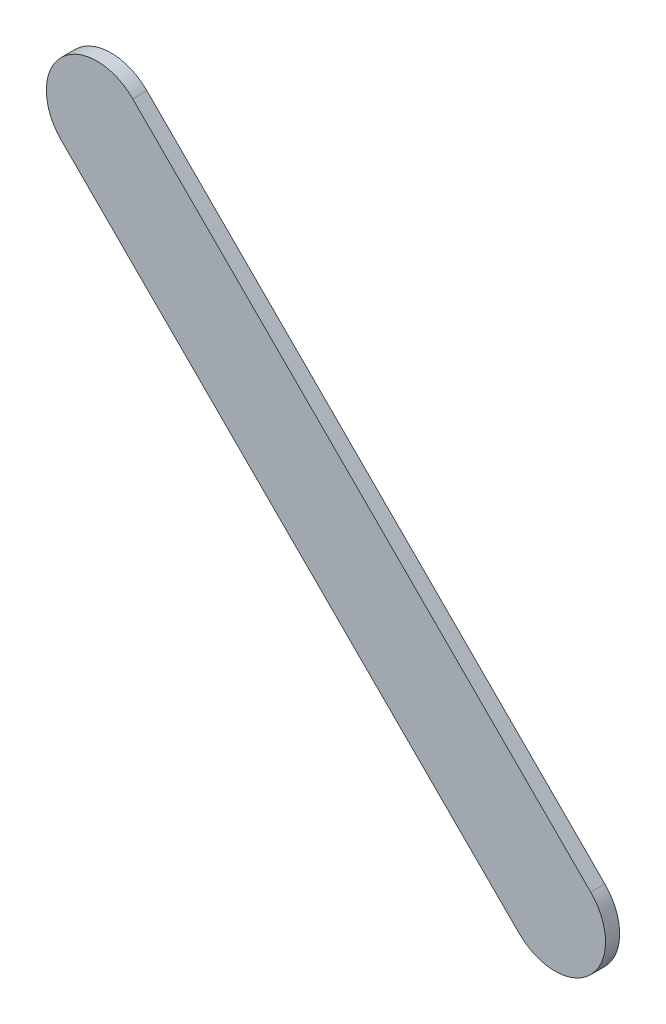
ISO-10303-21;
HEADER;
FILE_DESCRIPTION(('STEP AP214'),'2;1');
FILE_NAME('part.step','',(''),(''),'','','');
FILE_SCHEMA(('AUTOMOTIVE_DESIGN { 1 0 10303 214 1 1 1 1 }'));
ENDSEC;
DATA;
#1=APPLICATION_CONTEXT('core data for automotive mechanical design processes');
#2=APPLICATION_PROTOCOL_DEFINITION('international standard','automotive_design',2000,#1);
#3=PRODUCT_CONTEXT('',#1,'mechanical');
#4=PRODUCT('Part','Part','',(#3));
#5=PRODUCT_RELATED_PRODUCT_CATEGORY('part','',(#4));
#6=PRODUCT_DEFINITION_FORMATION('','',#4);
#7=PRODUCT_DEFINITION_CONTEXT('part definition',#1,'design');
#8=PRODUCT_DEFINITION('design','',#6,#7);
#9=PRODUCT_DEFINITION_SHAPE('','',#8);
#10=(LENGTH_UNIT() NAMED_UNIT(*) SI_UNIT(.MILLI.,.METRE.));
#11=(NAMED_UNIT(*) PLANE_ANGLE_UNIT() SI_UNIT($,.RADIAN.));
#12=(NAMED_UNIT(*) SI_UNIT($,.STERADIAN.) SOLID_ANGLE_UNIT());
#13=UNCERTAINTY_MEASURE_WITH_UNIT(LENGTH_MEASURE(1.E-05),#10,'distance_accuracy_value','');
#14=(GEOMETRIC_REPRESENTATION_CONTEXT(3) GLOBAL_UNCERTAINTY_ASSIGNED_CONTEXT((#13)) GLOBAL_UNIT_ASSIGNED_CONTEXT((#10,
#11,#12)) REPRESENTATION_CONTEXT('',''));
#15=CARTESIAN_POINT('',(0.,0.,0.));
#16=DIRECTION('',(0.,0.,1.));
#17=DIRECTION('',(1.,0.,0.));
#18=AXIS2_PLACEMENT_3D('',#15,#16,#17);
#19=CARTESIAN_POINT('',(98.12716976,96.79716988,0.));
#20=DIRECTION('',(0.707106781186552,0.707106781186543,0.));
#21=DIRECTION('',(0.707106781186543,-0.707106781186552,0.));
#22=AXIS2_PLACEMENT_3D('',#19,#20,#21);
#23=PLANE('',#22);
#24=DIRECTION('',(0.707106781186543,-0.707106781186552,0.));
#25=VECTOR('',#24,1.);
#26=CARTESIAN_POINT('',(98.12716976,96.79716988,0.03556));
#27=LINE('',#26,#25);
#28=CARTESIAN_POINT('',(98.12716976,96.79716988,0.03556));
#29=VERTEX_POINT('',#28);
#30=CARTESIAN_POINT('',(99.2771827,95.64715694,0.03556));
#31=VERTEX_POINT('',#30);
#32=EDGE_CURVE('E11',#29,#31,#27,.T.);
#33=ORIENTED_EDGE('',*,*,#32,.F.);
#34=DIRECTION('',(0.,0.,1.));
#35=VECTOR('',#34,1.);
#36=CARTESIAN_POINT('',(98.12716976,96.79716988,0.));
#37=LINE('',#36,#35);
#38=CARTESIAN_POINT('',(98.12716976,96.79716988,0.));
#39=VERTEX_POINT('',#38);
#40=EDGE_CURVE('E24',#39,#29,#37,.T.);
#41=ORIENTED_EDGE('',*,*,#40,.F.);
#42=DIRECTION('',(0.707106781186543,-0.707106781186552,0.));
#43=VECTOR('',#42,1.);
#44=CARTESIAN_POINT('',(98.12716976,96.79716988,0.));
#45=LINE('',#44,#43);
#46=CARTESIAN_POINT('',(99.2771827,95.64715694,0.));
#47=VERTEX_POINT('',#46);
#48=EDGE_CURVE('E75',#39,#47,#45,.T.);
#49=ORIENTED_EDGE('',*,*,#48,.T.);
#50=DIRECTION('',(0.,0.,1.));
#51=VECTOR('',#50,1.);
#52=CARTESIAN_POINT('',(99.2771827,95.64715694,0.));
#53=LINE('',#52,#51);
#54=EDGE_CURVE('E37',#47,#31,#53,.T.);
#55=ORIENTED_EDGE('',*,*,#54,.T.);
#56=EDGE_LOOP('',(#33,#41,#49,#55));
#57=FACE_BOUND('',#56,.T.);
#58=ADVANCED_FACE('F17',(#57),#23,.F.);
#59=CARTESIAN_POINT('',(99.36698567,95.73695991,0.));
#60=DIRECTION('',(0.,0.,-1.));
#61=DIRECTION('',(-0.707106781186492,-0.707106781186604,0.));
#62=AXIS2_PLACEMENT_3D('',#59,#60,#61);
#63=CYLINDRICAL_SURFACE('',#62,0.127000578115389);
#64=CARTESIAN_POINT('',(99.36698567,95.73695991,0.03556));
#65=DIRECTION('',(0.,0.,1.));
#66=DIRECTION('',(-0.707106781186492,-0.707106781186604,0.));
#67=AXIS2_PLACEMENT_3D('',#64,#65,#66);
#68=CIRCLE('',#67,0.127000578115389);
#69=CARTESIAN_POINT('',(99.45678864,95.82676288,0.03556));
#70=VERTEX_POINT('',#69);
#71=EDGE_CURVE('E83',#31,#70,#68,.T.);
#72=ORIENTED_EDGE('',*,*,#71,.F.);
#73=ORIENTED_EDGE('',*,*,#54,.F.);
#74=CARTESIAN_POINT('',(99.36698567,95.73695991,0.));
#75=DIRECTION('',(0.,0.,1.));
#76=DIRECTION('',(-0.707106781186492,-0.707106781186604,0.));
#77=AXIS2_PLACEMENT_3D('',#74,#75,#76);
#78=CIRCLE('',#77,0.127000578115389);
#79=CARTESIAN_POINT('',(99.45678864,95.82676288,0.));
#80=VERTEX_POINT('',#79);
#81=EDGE_CURVE('E81',#47,#80,#78,.T.);
#82=ORIENTED_EDGE('',*,*,#81,.T.);
#83=DIRECTION('',(0.,0.,1.));
#84=VECTOR('',#83,1.);
#85=CARTESIAN_POINT('',(99.45678864,95.82676288,0.));
#86=LINE('',#85,#84);
#87=EDGE_CURVE('E67',#80,#70,#86,.T.);
#88=ORIENTED_EDGE('',*,*,#87,.T.);
#89=EDGE_LOOP('',(#72,#73,#82,#88));
#90=FACE_BOUND('',#89,.T.);
#91=ADVANCED_FACE('F89',(#90),#63,.T.);
#92=CARTESIAN_POINT('',(99.45678864,95.82676288,0.));
#93=DIRECTION('',(-0.707106781186548,-0.707106781186548,0.));
#94=DIRECTION('',(-0.707106781186548,0.707106781186548,0.));
#95=AXIS2_PLACEMENT_3D('',#92,#93,#94);
#96=PLANE('',#95);
#97=DIRECTION('',(-0.707106781186548,0.707106781186548,0.));
#98=VECTOR('',#97,1.);
#99=CARTESIAN_POINT('',(99.45678864,95.82676288,0.03556));
#100=LINE('',#99,#98);
#101=CARTESIAN_POINT('',(98.3067757,96.97677582,0.03556));
#102=VERTEX_POINT('',#101);
#103=EDGE_CURVE('E71',#70,#102,#100,.T.);
#104=ORIENTED_EDGE('',*,*,#103,.F.);
#105=ORIENTED_EDGE('',*,*,#87,.F.);
#106=DIRECTION('',(-0.707106781186548,0.707106781186548,0.));
#107=VECTOR('',#106,1.);
#108=CARTESIAN_POINT('',(99.45678864,95.82676288,0.));
#109=LINE('',#108,#107);
#110=CARTESIAN_POINT('',(98.3067757,96.97677582,0.));
#111=VERTEX_POINT('',#110);
#112=EDGE_CURVE('E63',#80,#111,#109,.T.);
#113=ORIENTED_EDGE('',*,*,#112,.T.);
#114=DIRECTION('',(0.,0.,1.));
#115=VECTOR('',#114,1.);
#116=CARTESIAN_POINT('',(98.3067757,96.97677582,0.));
#117=LINE('',#116,#115);
#118=EDGE_CURVE('E53',#111,#102,#117,.T.);
#119=ORIENTED_EDGE('',*,*,#118,.T.);
#120=EDGE_LOOP('',(#104,#105,#113,#119));
#121=FACE_BOUND('',#120,.T.);
#122=ADVANCED_FACE('F66',(#121),#96,.F.);
#123=CARTESIAN_POINT('',(98.21697273,96.88697285,0.));
#124=DIRECTION('',(0.,0.,-1.));
#125=DIRECTION('',(0.707106781186548,0.707106781186548,0.));
#126=AXIS2_PLACEMENT_3D('',#123,#124,#125);
#127=CYLINDRICAL_SURFACE('',#126,0.127000578115382);
#128=CARTESIAN_POINT('',(98.21697273,96.88697285,0.03556));
#129=DIRECTION('',(0.,0.,1.));
#130=DIRECTION('',(0.707106781186548,0.707106781186548,0.));
#131=AXIS2_PLACEMENT_3D('',#128,#129,#130);
#132=CIRCLE('',#131,0.127000578115382);
#133=EDGE_CURVE('E59',#102,#29,#132,.T.);
#134=ORIENTED_EDGE('',*,*,#133,.F.);
#135=ORIENTED_EDGE('',*,*,#118,.F.);
#136=CARTESIAN_POINT('',(98.21697273,96.88697285,0.));
#137=DIRECTION('',(0.,0.,1.));
#138=DIRECTION('',(0.707106781186548,0.707106781186548,0.));
#139=AXIS2_PLACEMENT_3D('',#136,#137,#138);
#140=CIRCLE('',#139,0.127000578115382);
#141=EDGE_CURVE('E57',#111,#39,#140,.T.);
#142=ORIENTED_EDGE('',*,*,#141,.T.);
#143=ORIENTED_EDGE('',*,*,#40,.T.);
#144=EDGE_LOOP('',(#134,#135,#142,#143));
#145=FACE_BOUND('',#144,.T.);
#146=ADVANCED_FACE('F55',(#145),#127,.T.);
#147=CARTESIAN_POINT('',(98.12716976,96.79716988,0.));
#148=DIRECTION('',(0.,0.,-1.));
#149=DIRECTION('',(-1.,0.,0.));
#150=AXIS2_PLACEMENT_3D('',#147,#148,#149);
#151=PLANE('',#150);
#152=ORIENTED_EDGE('',*,*,#141,.F.);
#153=ORIENTED_EDGE('',*,*,#112,.F.);
#154=ORIENTED_EDGE('',*,*,#81,.F.);
#155=ORIENTED_EDGE('',*,*,#48,.F.);
#156=EDGE_LOOP('',(#152,#153,#154,#155));
#157=FACE_BOUND('',#156,.T.);
#158=ADVANCED_FACE('F74',(#157),#151,.T.);
#159=CARTESIAN_POINT('',(98.12716976,96.79716988,0.03556));
#160=DIRECTION('',(0.,0.,-1.));
#161=DIRECTION('',(-1.,0.,0.));
#162=AXIS2_PLACEMENT_3D('',#159,#160,#161);
#163=PLANE('',#162);
#164=ORIENTED_EDGE('',*,*,#32,.T.);
#165=ORIENTED_EDGE('',*,*,#71,.T.);
#166=ORIENTED_EDGE('',*,*,#103,.T.);
#167=ORIENTED_EDGE('',*,*,#133,.T.);
#168=EDGE_LOOP('',(#164,#165,#166,#167));
#169=FACE_BOUND('',#168,.T.);
#170=ADVANCED_FACE('F91',(#169),#163,.F.);
#171=CLOSED_SHELL('',(#58,#91,#122,#146,#158,#170));
#172=MANIFOLD_SOLID_BREP('B1',#171);
#173=ADVANCED_BREP_SHAPE_REPRESENTATION('',(#18,#172),#14);
#174=SHAPE_DEFINITION_REPRESENTATION(#9,#173);
ENDSEC;
END-ISO-10303-21;
